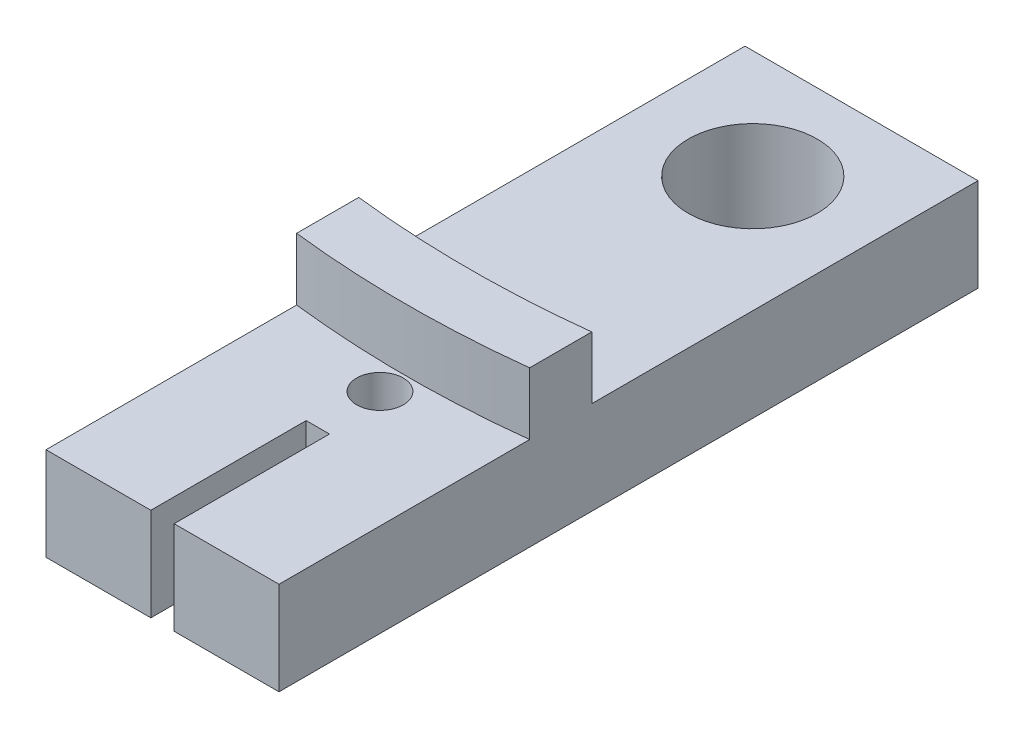
ISO-10303-21;
HEADER;
FILE_DESCRIPTION(('STEP AP214'),'2;1');
FILE_NAME('part.step','',(''),(''),'','','');
FILE_SCHEMA(('AUTOMOTIVE_DESIGN { 1 0 10303 214 1 1 1 1 }'));
ENDSEC;
DATA;
#1=APPLICATION_CONTEXT('core data for automotive mechanical design processes');
#2=APPLICATION_PROTOCOL_DEFINITION('international standard','automotive_design',2000,#1);
#3=PRODUCT_CONTEXT('',#1,'mechanical');
#4=PRODUCT('Part','Part','',(#3));
#5=PRODUCT_RELATED_PRODUCT_CATEGORY('part','',(#4));
#6=PRODUCT_DEFINITION_FORMATION('','',#4);
#7=PRODUCT_DEFINITION_CONTEXT('part definition',#1,'design');
#8=PRODUCT_DEFINITION('design','',#6,#7);
#9=PRODUCT_DEFINITION_SHAPE('','',#8);
#10=(LENGTH_UNIT() NAMED_UNIT(*) SI_UNIT(.MILLI.,.METRE.));
#11=(NAMED_UNIT(*) PLANE_ANGLE_UNIT() SI_UNIT($,.RADIAN.));
#12=(NAMED_UNIT(*) SI_UNIT($,.STERADIAN.) SOLID_ANGLE_UNIT());
#13=UNCERTAINTY_MEASURE_WITH_UNIT(LENGTH_MEASURE(1.E-05),#10,'distance_accuracy_value','');
#14=(GEOMETRIC_REPRESENTATION_CONTEXT(3) GLOBAL_UNCERTAINTY_ASSIGNED_CONTEXT((#13)) GLOBAL_UNIT_ASSIGNED_CONTEXT((#10,
#11,#12)) REPRESENTATION_CONTEXT('',''));
#15=CARTESIAN_POINT('',(0.,0.,0.));
#16=DIRECTION('',(0.,0.,1.));
#17=DIRECTION('',(1.,0.,0.));
#18=AXIS2_PLACEMENT_3D('',#15,#16,#17);
#19=CARTESIAN_POINT('',(7.50000000000001,6.,17.5));
#20=DIRECTION('',(0.,0.,-1.));
#21=DIRECTION('',(-1.,0.,0.));
#22=AXIS2_PLACEMENT_3D('',#19,#20,#21);
#23=PLANE('',#22);
#24=DIRECTION('',(0.,1.,0.));
#25=VECTOR('',#24,1.);
#26=CARTESIAN_POINT('',(-0.749999999999996,6.,17.5));
#27=LINE('',#26,#25);
#28=CARTESIAN_POINT('',(-0.749999999999995,0.,17.5));
#29=VERTEX_POINT('',#28);
#30=CARTESIAN_POINT('',(-0.749999999999995,6.,17.5));
#31=VERTEX_POINT('',#30);
#32=EDGE_CURVE('E53',#29,#31,#27,.T.);
#33=ORIENTED_EDGE('',*,*,#32,.F.);
#34=DIRECTION('',(1.,0.,0.));
#35=VECTOR('',#34,1.);
#36=CARTESIAN_POINT('',(7.50000000000001,0.,17.5));
#37=LINE('',#36,#35);
#38=CARTESIAN_POINT('',(0.750000000000004,0.,17.5));
#39=VERTEX_POINT('',#38);
#40=EDGE_CURVE('E131',#29,#39,#37,.T.);
#41=ORIENTED_EDGE('',*,*,#40,.T.);
#42=DIRECTION('',(0.,-1.,0.));
#43=VECTOR('',#42,1.);
#44=CARTESIAN_POINT('',(0.750000000000004,6.,17.5));
#45=LINE('',#44,#43);
#46=CARTESIAN_POINT('',(0.750000000000004,6.,17.5));
#47=VERTEX_POINT('',#46);
#48=EDGE_CURVE('E157',#47,#39,#45,.T.);
#49=ORIENTED_EDGE('',*,*,#48,.F.);
#50=DIRECTION('',(1.,0.,0.));
#51=VECTOR('',#50,1.);
#52=CARTESIAN_POINT('',(7.50000000000001,6.,17.5));
#53=LINE('',#52,#51);
#54=EDGE_CURVE('E49',#31,#47,#53,.T.);
#55=ORIENTED_EDGE('',*,*,#54,.F.);
#56=EDGE_LOOP('',(#33,#41,#49,#55));
#57=FACE_BOUND('',#56,.T.);
#58=ADVANCED_FACE('F34',(#57),#23,.F.);
#59=CARTESIAN_POINT('',(0.,6.,0.));
#60=DIRECTION('',(0.,1.,0.));
#61=DIRECTION('',(0.,0.,1.));
#62=AXIS2_PLACEMENT_3D('',#59,#60,#61);
#63=PLANE('',#62);
#64=CARTESIAN_POINT('',(0.,6.,-57.2));
#65=DIRECTION('',(0.,-1.,0.));
#66=DIRECTION('',(0.,0.,-1.));
#67=AXIS2_PLACEMENT_3D('',#64,#65,#66);
#68=CIRCLE('',#67,65.);
#69=CARTESIAN_POINT('',(7.50000000000001,6.,7.36585785072479));
#70=VERTEX_POINT('',#69);
#71=CARTESIAN_POINT('',(-7.5,6.,7.36585785072479));
#72=VERTEX_POINT('',#71);
#73=EDGE_CURVE('E176',#70,#72,#68,.T.);
#74=ORIENTED_EDGE('',*,*,#73,.F.);
#75=DIRECTION('',(0.,0.,-1.));
#76=VECTOR('',#75,1.);
#77=CARTESIAN_POINT('',(7.50000000000001,6.,17.5));
#78=LINE('',#77,#76);
#79=CARTESIAN_POINT('',(7.5,6.,-17.5));
#80=VERTEX_POINT('',#79);
#81=EDGE_CURVE('E218',#70,#80,#78,.T.);
#82=ORIENTED_EDGE('',*,*,#81,.T.);
#83=DIRECTION('',(-1.,0.,0.));
#84=VECTOR('',#83,1.);
#85=CARTESIAN_POINT('',(7.5,6.,-17.5));
#86=LINE('',#85,#84);
#87=CARTESIAN_POINT('',(-7.5,6.,-17.5));
#88=VERTEX_POINT('',#87);
#89=EDGE_CURVE('E221',#80,#88,#86,.T.);
#90=ORIENTED_EDGE('',*,*,#89,.T.);
#91=DIRECTION('',(0.,0.,1.));
#92=VECTOR('',#91,1.);
#93=CARTESIAN_POINT('',(-7.5,6.,17.5));
#94=LINE('',#93,#92);
#95=EDGE_CURVE('E214',#88,#72,#94,.T.);
#96=ORIENTED_EDGE('',*,*,#95,.T.);
#97=EDGE_LOOP('',(#74,#82,#90,#96));
#98=FACE_BOUND('',#97,.T.);
#99=CARTESIAN_POINT('',(0.,6.,-10.5));
#100=DIRECTION('',(0.,1.,0.));
#101=DIRECTION('',(0.,0.,1.));
#102=AXIS2_PLACEMENT_3D('',#99,#100,#101);
#103=CIRCLE('',#102,4.15);
#104=CARTESIAN_POINT('',(0.,6.,-6.35000000000002));
#105=VERTEX_POINT('',#104);
#106=EDGE_CURVE('E132',#105,#105,#103,.T.);
#107=ORIENTED_EDGE('',*,*,#106,.F.);
#108=EDGE_LOOP('',(#107));
#109=FACE_BOUND('',#108,.T.);
#110=ADVANCED_FACE('F246',(#98,#109),#63,.T.);
#111=CARTESIAN_POINT('',(0.,6.,-53.2));
#112=DIRECTION('',(0.,1.,0.));
#113=DIRECTION('',(0.,0.,1.));
#114=AXIS2_PLACEMENT_3D('',#111,#112,#113);
#115=CIRCLE('',#114,65.);
#116=CARTESIAN_POINT('',(-7.5,6.,11.3658578507248));
#117=VERTEX_POINT('',#116);
#118=CARTESIAN_POINT('',(7.50000000000001,6.,11.3658578507248));
#119=VERTEX_POINT('',#118);
#120=EDGE_CURVE('E181',#117,#119,#115,.T.);
#121=ORIENTED_EDGE('',*,*,#120,.F.);
#122=CARTESIAN_POINT('',(-7.5,6.,27.5));
#123=VERTEX_POINT('',#122);
#124=EDGE_CURVE('E216',#117,#123,#94,.T.);
#125=ORIENTED_EDGE('',*,*,#124,.T.);
#126=DIRECTION('',(-1.,0.,0.));
#127=VECTOR('',#126,1.);
#128=CARTESIAN_POINT('',(-0.749999999999996,6.,27.5));
#129=LINE('',#128,#127);
#130=CARTESIAN_POINT('',(-0.749999999999996,6.,27.5));
#131=VERTEX_POINT('',#130);
#132=EDGE_CURVE('E147',#131,#123,#129,.T.);
#133=ORIENTED_EDGE('',*,*,#132,.F.);
#134=DIRECTION('',(0.,0.,-1.));
#135=VECTOR('',#134,1.);
#136=CARTESIAN_POINT('',(-0.749999999999996,6.,27.5));
#137=LINE('',#136,#135);
#138=EDGE_CURVE('E152',#131,#31,#137,.T.);
#139=ORIENTED_EDGE('',*,*,#138,.T.);
#140=ORIENTED_EDGE('',*,*,#54,.T.);
#141=DIRECTION('',(0.,0.,-1.));
#142=VECTOR('',#141,1.);
#143=CARTESIAN_POINT('',(0.750000000000004,6.,27.5));
#144=LINE('',#143,#142);
#145=CARTESIAN_POINT('',(0.750000000000004,6.,27.5));
#146=VERTEX_POINT('',#145);
#147=EDGE_CURVE('E173',#146,#47,#144,.T.);
#148=ORIENTED_EDGE('',*,*,#147,.F.);
#149=DIRECTION('',(-1.,0.,0.));
#150=VECTOR('',#149,1.);
#151=CARTESIAN_POINT('',(0.750000000000004,6.,27.5));
#152=LINE('',#151,#150);
#153=CARTESIAN_POINT('',(7.50000000000001,6.,27.5));
#154=VERTEX_POINT('',#153);
#155=EDGE_CURVE('E161',#154,#146,#152,.T.);
#156=ORIENTED_EDGE('',*,*,#155,.F.);
#157=EDGE_CURVE('E219',#154,#119,#78,.T.);
#158=ORIENTED_EDGE('',*,*,#157,.T.);
#159=EDGE_LOOP('',(#121,#125,#133,#139,#140,#148,#156,#158));
#160=FACE_BOUND('',#159,.T.);
#161=CARTESIAN_POINT('',(0.,6.,13.5));
#162=DIRECTION('',(0.,1.,0.));
#163=DIRECTION('',(0.,0.,1.));
#164=AXIS2_PLACEMENT_3D('',#161,#162,#163);
#165=CIRCLE('',#164,1.5);
#166=CARTESIAN_POINT('',(0.,6.,15.));
#167=VERTEX_POINT('',#166);
#168=EDGE_CURVE('E204',#167,#167,#165,.T.);
#169=ORIENTED_EDGE('',*,*,#168,.F.);
#170=EDGE_LOOP('',(#169));
#171=FACE_BOUND('',#170,.T.);
#172=ADVANCED_FACE('F229',(#160,#171),#63,.T.);
#173=CARTESIAN_POINT('',(0.,0.,0.));
#174=DIRECTION('',(0.,1.,0.));
#175=DIRECTION('',(0.,0.,1.));
#176=AXIS2_PLACEMENT_3D('',#173,#174,#175);
#177=PLANE('',#176);
#178=DIRECTION('',(0.,0.,1.));
#179=VECTOR('',#178,1.);
#180=CARTESIAN_POINT('',(-7.5,0.,17.5));
#181=LINE('',#180,#179);
#182=CARTESIAN_POINT('',(-7.5,0.,-17.5));
#183=VERTEX_POINT('',#182);
#184=CARTESIAN_POINT('',(-7.5,0.,27.5));
#185=VERTEX_POINT('',#184);
#186=EDGE_CURVE('E122',#183,#185,#181,.T.);
#187=ORIENTED_EDGE('',*,*,#186,.F.);
#188=DIRECTION('',(-1.,0.,0.));
#189=VECTOR('',#188,1.);
#190=CARTESIAN_POINT('',(7.5,0.,-17.5));
#191=LINE('',#190,#189);
#192=CARTESIAN_POINT('',(7.5,0.,-17.5));
#193=VERTEX_POINT('',#192);
#194=EDGE_CURVE('E226',#193,#183,#191,.T.);
#195=ORIENTED_EDGE('',*,*,#194,.F.);
#196=DIRECTION('',(0.,0.,-1.));
#197=VECTOR('',#196,1.);
#198=CARTESIAN_POINT('',(7.50000000000001,0.,17.5));
#199=LINE('',#198,#197);
#200=CARTESIAN_POINT('',(7.50000000000001,0.,27.5));
#201=VERTEX_POINT('',#200);
#202=EDGE_CURVE('E224',#201,#193,#199,.T.);
#203=ORIENTED_EDGE('',*,*,#202,.F.);
#204=DIRECTION('',(1.,0.,0.));
#205=VECTOR('',#204,1.);
#206=CARTESIAN_POINT('',(0.750000000000004,0.,27.5));
#207=LINE('',#206,#205);
#208=CARTESIAN_POINT('',(0.750000000000004,0.,27.5));
#209=VERTEX_POINT('',#208);
#210=EDGE_CURVE('E165',#209,#201,#207,.T.);
#211=ORIENTED_EDGE('',*,*,#210,.F.);
#212=DIRECTION('',(0.,0.,-1.));
#213=VECTOR('',#212,1.);
#214=CARTESIAN_POINT('',(0.750000000000004,0.,27.5));
#215=LINE('',#214,#213);
#216=EDGE_CURVE('E168',#209,#39,#215,.T.);
#217=ORIENTED_EDGE('',*,*,#216,.T.);
#218=ORIENTED_EDGE('',*,*,#40,.F.);
#219=DIRECTION('',(0.,0.,-1.));
#220=VECTOR('',#219,1.);
#221=CARTESIAN_POINT('',(-0.749999999999996,0.,27.5));
#222=LINE('',#221,#220);
#223=CARTESIAN_POINT('',(-0.749999999999996,0.,27.5));
#224=VERTEX_POINT('',#223);
#225=EDGE_CURVE('E139',#224,#29,#222,.T.);
#226=ORIENTED_EDGE('',*,*,#225,.F.);
#227=DIRECTION('',(1.,0.,0.));
#228=VECTOR('',#227,1.);
#229=CARTESIAN_POINT('',(-0.749999999999996,0.,27.5));
#230=LINE('',#229,#228);
#231=EDGE_CURVE('E135',#185,#224,#230,.T.);
#232=ORIENTED_EDGE('',*,*,#231,.F.);
#233=EDGE_LOOP('',(#187,#195,#203,#211,#217,#218,#226,#232));
#234=FACE_BOUND('',#233,.T.);
#235=CARTESIAN_POINT('',(0.,0.,-10.5));
#236=DIRECTION('',(0.,1.,0.));
#237=DIRECTION('',(0.,0.,1.));
#238=AXIS2_PLACEMENT_3D('',#235,#236,#237);
#239=CIRCLE('',#238,4.15);
#240=CARTESIAN_POINT('',(0.,0.,-6.35000000000002));
#241=VERTEX_POINT('',#240);
#242=EDGE_CURVE('E207',#241,#241,#239,.T.);
#243=ORIENTED_EDGE('',*,*,#242,.T.);
#244=EDGE_LOOP('',(#243));
#245=FACE_BOUND('',#244,.T.);
#246=CARTESIAN_POINT('',(0.,0.,13.5));
#247=DIRECTION('',(0.,1.,0.));
#248=DIRECTION('',(0.,0.,1.));
#249=AXIS2_PLACEMENT_3D('',#246,#247,#248);
#250=CIRCLE('',#249,1.5);
#251=CARTESIAN_POINT('',(0.,0.,15.));
#252=VERTEX_POINT('',#251);
#253=EDGE_CURVE('E203',#252,#252,#250,.T.);
#254=ORIENTED_EDGE('',*,*,#253,.T.);
#255=EDGE_LOOP('',(#254));
#256=FACE_BOUND('',#255,.T.);
#257=ADVANCED_FACE('F136',(#234,#245,#256),#177,.F.);
#258=CARTESIAN_POINT('',(-7.5,6.,17.5));
#259=DIRECTION('',(1.,0.,0.));
#260=DIRECTION('',(0.,0.,-1.));
#261=AXIS2_PLACEMENT_3D('',#258,#259,#260);
#262=PLANE('',#261);
#263=ORIENTED_EDGE('',*,*,#186,.T.);
#264=DIRECTION('',(0.,-1.,0.));
#265=VECTOR('',#264,1.);
#266=CARTESIAN_POINT('',(-7.5,6.,27.5));
#267=LINE('',#266,#265);
#268=EDGE_CURVE('E126',#123,#185,#267,.T.);
#269=ORIENTED_EDGE('',*,*,#268,.F.);
#270=ORIENTED_EDGE('',*,*,#124,.F.);
#271=DIRECTION('',(0.,-1.,0.));
#272=VECTOR('',#271,1.);
#273=CARTESIAN_POINT('',(-7.50000000000005,10.,11.3658578507248));
#274=LINE('',#273,#272);
#275=CARTESIAN_POINT('',(-7.50000000000005,10.,11.3658578507248));
#276=VERTEX_POINT('',#275);
#277=EDGE_CURVE('E197',#276,#117,#274,.T.);
#278=ORIENTED_EDGE('',*,*,#277,.F.);
#279=DIRECTION('',(0.,0.,1.));
#280=VECTOR('',#279,1.);
#281=CARTESIAN_POINT('',(-7.5,10.,11.3658578507248));
#282=LINE('',#281,#280);
#283=CARTESIAN_POINT('',(-7.5,10.,7.36585785072478));
#284=VERTEX_POINT('',#283);
#285=EDGE_CURVE('E180',#284,#276,#282,.T.);
#286=ORIENTED_EDGE('',*,*,#285,.F.);
#287=DIRECTION('',(0.,-1.,0.));
#288=VECTOR('',#287,1.);
#289=CARTESIAN_POINT('',(-7.5,10.,7.36585785072478));
#290=LINE('',#289,#288);
#291=EDGE_CURVE('E200',#284,#72,#290,.T.);
#292=ORIENTED_EDGE('',*,*,#291,.T.);
#293=ORIENTED_EDGE('',*,*,#95,.F.);
#294=DIRECTION('',(0.,-1.,0.));
#295=VECTOR('',#294,1.);
#296=CARTESIAN_POINT('',(-7.5,6.,-17.5));
#297=LINE('',#296,#295);
#298=EDGE_CURVE('E42',#88,#183,#297,.T.);
#299=ORIENTED_EDGE('',*,*,#298,.T.);
#300=EDGE_LOOP('',(#263,#269,#270,#278,#286,#292,#293,#299));
#301=FACE_BOUND('',#300,.T.);
#302=ADVANCED_FACE('F36',(#301),#262,.F.);
#303=CARTESIAN_POINT('',(7.50000000000001,6.,17.5));
#304=DIRECTION('',(-1.,0.,0.));
#305=DIRECTION('',(0.,0.,1.));
#306=AXIS2_PLACEMENT_3D('',#303,#304,#305);
#307=PLANE('',#306);
#308=ORIENTED_EDGE('',*,*,#202,.T.);
#309=DIRECTION('',(0.,-1.,0.));
#310=VECTOR('',#309,1.);
#311=CARTESIAN_POINT('',(7.5,6.,-17.5));
#312=LINE('',#311,#310);
#313=EDGE_CURVE('E11',#80,#193,#312,.T.);
#314=ORIENTED_EDGE('',*,*,#313,.F.);
#315=ORIENTED_EDGE('',*,*,#81,.F.);
#316=DIRECTION('',(0.,-1.,0.));
#317=VECTOR('',#316,1.);
#318=CARTESIAN_POINT('',(7.50000000000001,10.,7.36585785072477));
#319=LINE('',#318,#317);
#320=CARTESIAN_POINT('',(7.50000000000001,10.,7.36585785072477));
#321=VERTEX_POINT('',#320);
#322=EDGE_CURVE('E187',#321,#70,#319,.T.);
#323=ORIENTED_EDGE('',*,*,#322,.F.);
#324=DIRECTION('',(0.,0.,-1.));
#325=VECTOR('',#324,1.);
#326=CARTESIAN_POINT('',(7.50000000000001,10.,7.36585785072477));
#327=LINE('',#326,#325);
#328=CARTESIAN_POINT('',(7.50000000000001,10.,11.3658578507248));
#329=VERTEX_POINT('',#328);
#330=EDGE_CURVE('E185',#329,#321,#327,.T.);
#331=ORIENTED_EDGE('',*,*,#330,.F.);
#332=DIRECTION('',(0.,-1.,0.));
#333=VECTOR('',#332,1.);
#334=CARTESIAN_POINT('',(7.50000000000001,10.,11.3658578507248));
#335=LINE('',#334,#333);
#336=EDGE_CURVE('E194',#329,#119,#335,.T.);
#337=ORIENTED_EDGE('',*,*,#336,.T.);
#338=ORIENTED_EDGE('',*,*,#157,.F.);
#339=DIRECTION('',(0.,1.,0.));
#340=VECTOR('',#339,1.);
#341=CARTESIAN_POINT('',(7.50000000000001,6.,27.5));
#342=LINE('',#341,#340);
#343=EDGE_CURVE('E158',#201,#154,#342,.T.);
#344=ORIENTED_EDGE('',*,*,#343,.F.);
#345=EDGE_LOOP('',(#308,#314,#315,#323,#331,#337,#338,#344));
#346=FACE_BOUND('',#345,.T.);
#347=ADVANCED_FACE('F250',(#346),#307,.F.);
#348=CARTESIAN_POINT('',(7.5,6.,-17.5));
#349=DIRECTION('',(0.,0.,1.));
#350=DIRECTION('',(1.,0.,0.));
#351=AXIS2_PLACEMENT_3D('',#348,#349,#350);
#352=PLANE('',#351);
#353=ORIENTED_EDGE('',*,*,#194,.T.);
#354=ORIENTED_EDGE('',*,*,#298,.F.);
#355=ORIENTED_EDGE('',*,*,#89,.F.);
#356=ORIENTED_EDGE('',*,*,#313,.T.);
#357=EDGE_LOOP('',(#353,#354,#355,#356));
#358=FACE_BOUND('',#357,.T.);
#359=ADVANCED_FACE('F253',(#358),#352,.F.);
#360=CARTESIAN_POINT('',(0.,6.,-10.5));
#361=DIRECTION('',(0.,-1.,0.));
#362=DIRECTION('',(0.,0.,-1.));
#363=AXIS2_PLACEMENT_3D('',#360,#361,#362);
#364=CYLINDRICAL_SURFACE('',#363,4.15);
#365=ORIENTED_EDGE('',*,*,#106,.T.);
#366=EDGE_LOOP('',(#365));
#367=FACE_BOUND('',#366,.T.);
#368=ORIENTED_EDGE('',*,*,#242,.F.);
#369=EDGE_LOOP('',(#368));
#370=FACE_BOUND('',#369,.T.);
#371=ADVANCED_FACE('F255',(#367,#370),#364,.F.);
#372=CARTESIAN_POINT('',(0.,6.,13.5));
#373=DIRECTION('',(0.,-1.,0.));
#374=DIRECTION('',(0.,0.,-1.));
#375=AXIS2_PLACEMENT_3D('',#372,#373,#374);
#376=CYLINDRICAL_SURFACE('',#375,1.5);
#377=ORIENTED_EDGE('',*,*,#168,.T.);
#378=EDGE_LOOP('',(#377));
#379=FACE_BOUND('',#378,.T.);
#380=ORIENTED_EDGE('',*,*,#253,.F.);
#381=EDGE_LOOP('',(#380));
#382=FACE_BOUND('',#381,.T.);
#383=ADVANCED_FACE('F261',(#379,#382),#376,.F.);
#384=CARTESIAN_POINT('',(0.,10.,-57.2));
#385=DIRECTION('',(0.,-1.,0.));
#386=DIRECTION('',(0.,0.,-1.));
#387=AXIS2_PLACEMENT_3D('',#384,#385,#386);
#388=CYLINDRICAL_SURFACE('',#387,65.);
#389=ORIENTED_EDGE('',*,*,#73,.T.);
#390=ORIENTED_EDGE('',*,*,#291,.F.);
#391=CARTESIAN_POINT('',(0.,10.,-57.2));
#392=DIRECTION('',(0.,-1.,0.));
#393=DIRECTION('',(0.,0.,-1.));
#394=AXIS2_PLACEMENT_3D('',#391,#392,#393);
#395=CIRCLE('',#394,65.);
#396=EDGE_CURVE('E177',#321,#284,#395,.T.);
#397=ORIENTED_EDGE('',*,*,#396,.F.);
#398=ORIENTED_EDGE('',*,*,#322,.T.);
#399=EDGE_LOOP('',(#389,#390,#397,#398));
#400=FACE_BOUND('',#399,.T.);
#401=ADVANCED_FACE('F243',(#400),#388,.F.);
#402=CARTESIAN_POINT('',(0.,10.,-53.2));
#403=DIRECTION('',(0.,-1.,0.));
#404=DIRECTION('',(0.,0.,-1.));
#405=AXIS2_PLACEMENT_3D('',#402,#403,#404);
#406=CYLINDRICAL_SURFACE('',#405,65.);
#407=ORIENTED_EDGE('',*,*,#120,.T.);
#408=ORIENTED_EDGE('',*,*,#336,.F.);
#409=CARTESIAN_POINT('',(0.,10.,-53.2));
#410=DIRECTION('',(0.,1.,0.));
#411=DIRECTION('',(0.,0.,1.));
#412=AXIS2_PLACEMENT_3D('',#409,#410,#411);
#413=CIRCLE('',#412,65.);
#414=EDGE_CURVE('E183',#276,#329,#413,.T.);
#415=ORIENTED_EDGE('',*,*,#414,.F.);
#416=ORIENTED_EDGE('',*,*,#277,.T.);
#417=EDGE_LOOP('',(#407,#408,#415,#416));
#418=FACE_BOUND('',#417,.T.);
#419=ADVANCED_FACE('F234',(#418),#406,.T.);
#420=CARTESIAN_POINT('',(0.,10.,-57.2));
#421=DIRECTION('',(0.,-1.,0.));
#422=DIRECTION('',(0.,0.,-1.));
#423=AXIS2_PLACEMENT_3D('',#420,#421,#422);
#424=PLANE('',#423);
#425=ORIENTED_EDGE('',*,*,#396,.T.);
#426=ORIENTED_EDGE('',*,*,#285,.T.);
#427=ORIENTED_EDGE('',*,*,#414,.T.);
#428=ORIENTED_EDGE('',*,*,#330,.T.);
#429=EDGE_LOOP('',(#425,#426,#427,#428));
#430=FACE_BOUND('',#429,.T.);
#431=ADVANCED_FACE('F238',(#430),#424,.F.);
#432=CARTESIAN_POINT('',(0.750000000000004,6.,27.5));
#433=DIRECTION('',(1.,0.,0.));
#434=DIRECTION('',(0.,0.,-1.));
#435=AXIS2_PLACEMENT_3D('',#432,#433,#434);
#436=PLANE('',#435);
#437=ORIENTED_EDGE('',*,*,#48,.T.);
#438=ORIENTED_EDGE('',*,*,#216,.F.);
#439=DIRECTION('',(0.,-1.,0.));
#440=VECTOR('',#439,1.);
#441=CARTESIAN_POINT('',(0.750000000000004,6.,27.5));
#442=LINE('',#441,#440);
#443=EDGE_CURVE('E163',#146,#209,#442,.T.);
#444=ORIENTED_EDGE('',*,*,#443,.F.);
#445=ORIENTED_EDGE('',*,*,#147,.T.);
#446=EDGE_LOOP('',(#437,#438,#444,#445));
#447=FACE_BOUND('',#446,.T.);
#448=ADVANCED_FACE('F292',(#447),#436,.F.);
#449=CARTESIAN_POINT('',(0.,0.,27.5));
#450=DIRECTION('',(0.,0.,1.));
#451=DIRECTION('',(1.,0.,0.));
#452=AXIS2_PLACEMENT_3D('',#449,#450,#451);
#453=PLANE('',#452);
#454=ORIENTED_EDGE('',*,*,#343,.T.);
#455=ORIENTED_EDGE('',*,*,#155,.T.);
#456=ORIENTED_EDGE('',*,*,#443,.T.);
#457=ORIENTED_EDGE('',*,*,#210,.T.);
#458=EDGE_LOOP('',(#454,#455,#456,#457));
#459=FACE_BOUND('',#458,.T.);
#460=ADVANCED_FACE('F296',(#459),#453,.T.);
#461=CARTESIAN_POINT('',(-0.749999999999996,6.,27.5));
#462=DIRECTION('',(-1.,0.,0.));
#463=DIRECTION('',(0.,0.,1.));
#464=AXIS2_PLACEMENT_3D('',#461,#462,#463);
#465=PLANE('',#464);
#466=ORIENTED_EDGE('',*,*,#32,.T.);
#467=ORIENTED_EDGE('',*,*,#138,.F.);
#468=DIRECTION('',(0.,1.,0.));
#469=VECTOR('',#468,1.);
#470=CARTESIAN_POINT('',(-0.749999999999996,6.,27.5));
#471=LINE('',#470,#469);
#472=EDGE_CURVE('E142',#224,#131,#471,.T.);
#473=ORIENTED_EDGE('',*,*,#472,.F.);
#474=ORIENTED_EDGE('',*,*,#225,.T.);
#475=EDGE_LOOP('',(#466,#467,#473,#474));
#476=FACE_BOUND('',#475,.T.);
#477=ADVANCED_FACE('F307',(#476),#465,.F.);
#478=CARTESIAN_POINT('',(0.,0.,27.5));
#479=DIRECTION('',(0.,0.,-1.));
#480=DIRECTION('',(-1.,0.,0.));
#481=AXIS2_PLACEMENT_3D('',#478,#479,#480);
#482=PLANE('',#481);
#483=ORIENTED_EDGE('',*,*,#268,.T.);
#484=ORIENTED_EDGE('',*,*,#231,.T.);
#485=ORIENTED_EDGE('',*,*,#472,.T.);
#486=ORIENTED_EDGE('',*,*,#132,.T.);
#487=EDGE_LOOP('',(#483,#484,#485,#486));
#488=FACE_BOUND('',#487,.T.);
#489=ADVANCED_FACE('F145',(#488),#482,.F.);
#490=CLOSED_SHELL('',(#58,#110,#172,#257,#302,#347,#359,#371,#383,#401,#419,#431,#448,#460,#477,#489));
#491=MANIFOLD_SOLID_BREP('B2',#490);
#492=ADVANCED_BREP_SHAPE_REPRESENTATION('',(#18,#491),#14);
#493=SHAPE_DEFINITION_REPRESENTATION(#9,#492);
ENDSEC;
END-ISO-10303-21;
